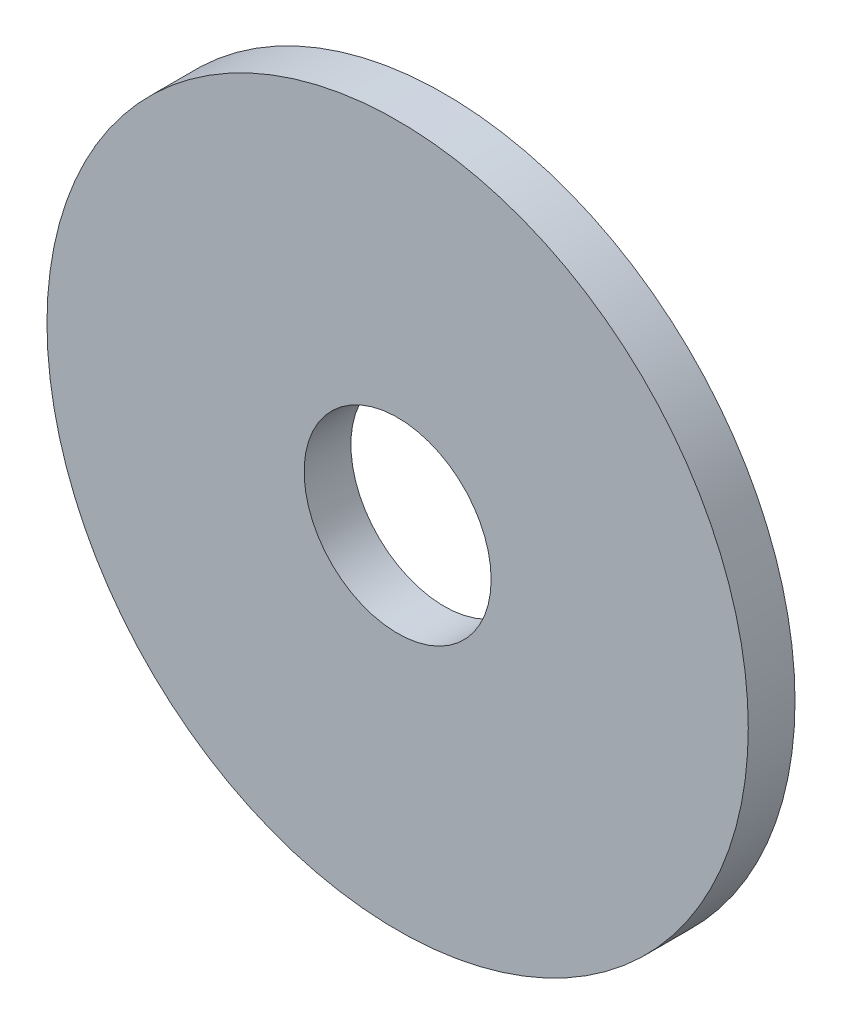
ISO-10303-21;
HEADER;
FILE_DESCRIPTION(('STEP AP214'),'2;1');
FILE_NAME('part.step','',(''),(''),'','','');
FILE_SCHEMA(('AUTOMOTIVE_DESIGN { 1 0 10303 214 1 1 1 1 }'));
ENDSEC;
DATA;
#1=APPLICATION_CONTEXT('core data for automotive mechanical design processes');
#2=APPLICATION_PROTOCOL_DEFINITION('international standard','automotive_design',2000,#1);
#3=PRODUCT_CONTEXT('',#1,'mechanical');
#4=PRODUCT('Part','Part','',(#3));
#5=PRODUCT_RELATED_PRODUCT_CATEGORY('part','',(#4));
#6=PRODUCT_DEFINITION_FORMATION('','',#4);
#7=PRODUCT_DEFINITION_CONTEXT('part definition',#1,'design');
#8=PRODUCT_DEFINITION('design','',#6,#7);
#9=PRODUCT_DEFINITION_SHAPE('','',#8);
#10=(LENGTH_UNIT() NAMED_UNIT(*) SI_UNIT(.MILLI.,.METRE.));
#11=(NAMED_UNIT(*) PLANE_ANGLE_UNIT() SI_UNIT($,.RADIAN.));
#12=(NAMED_UNIT(*) SI_UNIT($,.STERADIAN.) SOLID_ANGLE_UNIT());
#13=UNCERTAINTY_MEASURE_WITH_UNIT(LENGTH_MEASURE(1.E-05),#10,'distance_accuracy_value','');
#14=(GEOMETRIC_REPRESENTATION_CONTEXT(3) GLOBAL_UNCERTAINTY_ASSIGNED_CONTEXT((#13)) GLOBAL_UNIT_ASSIGNED_CONTEXT((#10,
#11,#12)) REPRESENTATION_CONTEXT('',''));
#15=CARTESIAN_POINT('',(0.,0.,0.));
#16=DIRECTION('',(0.,0.,1.));
#17=DIRECTION('',(1.,0.,0.));
#18=AXIS2_PLACEMENT_3D('',#15,#16,#17);
#19=CARTESIAN_POINT('',(0.,0.,2.));
#20=DIRECTION('',(0.,0.,1.));
#21=DIRECTION('',(1.,0.,0.));
#22=AXIS2_PLACEMENT_3D('',#19,#20,#21);
#23=PLANE('',#22);
#24=CARTESIAN_POINT('',(0.,0.,2.));
#25=DIRECTION('',(0.,0.,1.));
#26=DIRECTION('',(1.,0.,0.));
#27=AXIS2_PLACEMENT_3D('',#24,#25,#26);
#28=CIRCLE('',#27,15.);
#29=CARTESIAN_POINT('',(15.,0.,2.));
#30=VERTEX_POINT('',#29);
#31=EDGE_CURVE('E10',#30,#30,#28,.T.);
#32=ORIENTED_EDGE('',*,*,#31,.T.);
#33=EDGE_LOOP('',(#32));
#34=FACE_BOUND('',#33,.T.);
#35=CARTESIAN_POINT('',(0.,0.,2.));
#36=DIRECTION('',(0.,0.,1.));
#37=DIRECTION('',(1.,0.,0.));
#38=AXIS2_PLACEMENT_3D('',#35,#36,#37);
#39=CIRCLE('',#38,4.);
#40=CARTESIAN_POINT('',(4.,0.,2.));
#41=VERTEX_POINT('',#40);
#42=EDGE_CURVE('E36',#41,#41,#39,.T.);
#43=ORIENTED_EDGE('',*,*,#42,.F.);
#44=EDGE_LOOP('',(#43));
#45=FACE_BOUND('',#44,.T.);
#46=ADVANCED_FACE('F25',(#34,#45),#23,.T.);
#47=CARTESIAN_POINT('',(0.,0.,0.));
#48=DIRECTION('',(0.,0.,1.));
#49=DIRECTION('',(1.,0.,0.));
#50=AXIS2_PLACEMENT_3D('',#47,#48,#49);
#51=PLANE('',#50);
#52=CARTESIAN_POINT('',(0.,0.,0.));
#53=DIRECTION('',(0.,0.,1.));
#54=DIRECTION('',(1.,0.,0.));
#55=AXIS2_PLACEMENT_3D('',#52,#53,#54);
#56=CIRCLE('',#55,15.);
#57=CARTESIAN_POINT('',(15.,0.,0.));
#58=VERTEX_POINT('',#57);
#59=EDGE_CURVE('E32',#58,#58,#56,.T.);
#60=ORIENTED_EDGE('',*,*,#59,.F.);
#61=EDGE_LOOP('',(#60));
#62=FACE_BOUND('',#61,.T.);
#63=CARTESIAN_POINT('',(0.,0.,0.));
#64=DIRECTION('',(0.,0.,1.));
#65=DIRECTION('',(1.,0.,0.));
#66=AXIS2_PLACEMENT_3D('',#63,#64,#65);
#67=CIRCLE('',#66,4.);
#68=CARTESIAN_POINT('',(4.,0.,0.));
#69=VERTEX_POINT('',#68);
#70=EDGE_CURVE('E40',#69,#69,#67,.T.);
#71=ORIENTED_EDGE('',*,*,#70,.T.);
#72=EDGE_LOOP('',(#71));
#73=FACE_BOUND('',#72,.T.);
#74=ADVANCED_FACE('F46',(#62,#73),#51,.F.);
#75=CARTESIAN_POINT('',(0.,0.,2.));
#76=DIRECTION('',(0.,0.,-1.));
#77=DIRECTION('',(-1.,0.,0.));
#78=AXIS2_PLACEMENT_3D('',#75,#76,#77);
#79=CYLINDRICAL_SURFACE('',#78,15.);
#80=ORIENTED_EDGE('',*,*,#31,.F.);
#81=EDGE_LOOP('',(#80));
#82=FACE_BOUND('',#81,.T.);
#83=ORIENTED_EDGE('',*,*,#59,.T.);
#84=EDGE_LOOP('',(#83));
#85=FACE_BOUND('',#84,.T.);
#86=ADVANCED_FACE('F27',(#82,#85),#79,.T.);
#87=CARTESIAN_POINT('',(0.,0.,2.));
#88=DIRECTION('',(0.,0.,-1.));
#89=DIRECTION('',(-1.,0.,0.));
#90=AXIS2_PLACEMENT_3D('',#87,#88,#89);
#91=CYLINDRICAL_SURFACE('',#90,4.);
#92=ORIENTED_EDGE('',*,*,#42,.T.);
#93=EDGE_LOOP('',(#92));
#94=FACE_BOUND('',#93,.T.);
#95=ORIENTED_EDGE('',*,*,#70,.F.);
#96=EDGE_LOOP('',(#95));
#97=FACE_BOUND('',#96,.T.);
#98=ADVANCED_FACE('F48',(#94,#97),#91,.F.);
#99=CLOSED_SHELL('',(#46,#74,#86,#98));
#100=MANIFOLD_SOLID_BREP('B2',#99);
#101=ADVANCED_BREP_SHAPE_REPRESENTATION('',(#18,#100),#14);
#102=SHAPE_DEFINITION_REPRESENTATION(#9,#101);
ENDSEC;
END-ISO-10303-21;
